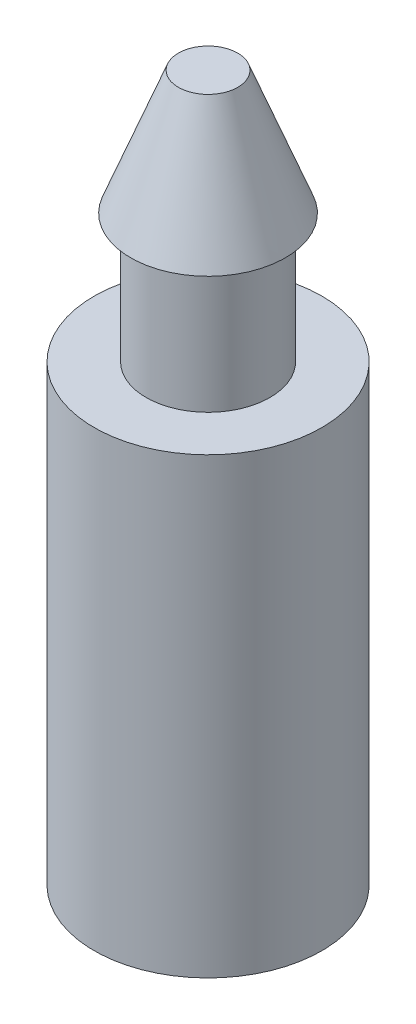
ISO-10303-21;
HEADER;
FILE_DESCRIPTION(('STEP AP214'),'2;1');
FILE_NAME('part.step','',(''),(''),'','','');
FILE_SCHEMA(('AUTOMOTIVE_DESIGN { 1 0 10303 214 1 1 1 1 }'));
ENDSEC;
DATA;
#1=APPLICATION_CONTEXT('core data for automotive mechanical design processes');
#2=APPLICATION_PROTOCOL_DEFINITION('international standard','automotive_design',2000,#1);
#3=PRODUCT_CONTEXT('',#1,'mechanical');
#4=PRODUCT('Part','Part','',(#3));
#5=PRODUCT_RELATED_PRODUCT_CATEGORY('part','',(#4));
#6=PRODUCT_DEFINITION_FORMATION('','',#4);
#7=PRODUCT_DEFINITION_CONTEXT('part definition',#1,'design');
#8=PRODUCT_DEFINITION('design','',#6,#7);
#9=PRODUCT_DEFINITION_SHAPE('','',#8);
#10=(LENGTH_UNIT() NAMED_UNIT(*) SI_UNIT(.MILLI.,.METRE.));
#11=(NAMED_UNIT(*) PLANE_ANGLE_UNIT() SI_UNIT($,.RADIAN.));
#12=(NAMED_UNIT(*) SI_UNIT($,.STERADIAN.) SOLID_ANGLE_UNIT());
#13=UNCERTAINTY_MEASURE_WITH_UNIT(LENGTH_MEASURE(1.E-05),#10,'distance_accuracy_value','');
#14=(GEOMETRIC_REPRESENTATION_CONTEXT(3) GLOBAL_UNCERTAINTY_ASSIGNED_CONTEXT((#13)) GLOBAL_UNIT_ASSIGNED_CONTEXT((#10,
#11,#12)) REPRESENTATION_CONTEXT('',''));
#15=CARTESIAN_POINT('',(0.,0.,0.));
#16=DIRECTION('',(0.,0.,1.));
#17=DIRECTION('',(1.,0.,0.));
#18=AXIS2_PLACEMENT_3D('',#15,#16,#17);
#19=CARTESIAN_POINT('',(1.1684,0.,0.));
#20=DIRECTION('',(0.,-1.,0.));
#21=DIRECTION('',(0.,0.,-1.));
#22=AXIS2_PLACEMENT_3D('',#19,#20,#21);
#23=PLANE('',#22);
#24=CARTESIAN_POINT('',(0.,0.,0.));
#25=DIRECTION('',(0.,-1.,0.));
#26=DIRECTION('',(0.,0.,-1.));
#27=AXIS2_PLACEMENT_3D('',#24,#25,#26);
#28=CIRCLE('',#27,1.1684);
#29=CARTESIAN_POINT('',(0.,0.,-1.1684));
#30=VERTEX_POINT('',#29);
#31=EDGE_CURVE('E67',#30,#30,#28,.T.);
#32=ORIENTED_EDGE('',*,*,#31,.T.);
#33=EDGE_LOOP('',(#32));
#34=FACE_BOUND('',#33,.T.);
#35=ADVANCED_FACE('F38',(#34),#23,.T.);
#36=CARTESIAN_POINT('',(0.,7.239,0.));
#37=DIRECTION('',(0.,1.,0.));
#38=DIRECTION('',(0.,0.,1.));
#39=AXIS2_PLACEMENT_3D('',#36,#37,#38);
#40=PLANE('',#39);
#41=CARTESIAN_POINT('',(0.,7.239,0.));
#42=DIRECTION('',(0.,-1.,0.));
#43=DIRECTION('',(0.,0.,-1.));
#44=AXIS2_PLACEMENT_3D('',#41,#42,#43);
#45=CIRCLE('',#44,0.304382522547571);
#46=CARTESIAN_POINT('',(0.,7.239,-0.304382522547571));
#47=VERTEX_POINT('',#46);
#48=EDGE_CURVE('E10',#47,#47,#45,.T.);
#49=ORIENTED_EDGE('',*,*,#48,.F.);
#50=EDGE_LOOP('',(#49));
#51=FACE_BOUND('',#50,.T.);
#52=ADVANCED_FACE('F86',(#51),#40,.T.);
#53=CARTESIAN_POINT('',(0.,5.969,0.));
#54=DIRECTION('',(0.,-1.,0.));
#55=DIRECTION('',(0.,0.,-1.));
#56=AXIS2_PLACEMENT_3D('',#53,#54,#55);
#57=CONICAL_SURFACE('',#56,0.79375,0.367795098068462);
#58=ORIENTED_EDGE('',*,*,#48,.T.);
#59=EDGE_LOOP('',(#58));
#60=FACE_BOUND('',#59,.T.);
#61=CARTESIAN_POINT('',(0.,5.969,0.));
#62=DIRECTION('',(0.,-1.,0.));
#63=DIRECTION('',(0.,0.,-1.));
#64=AXIS2_PLACEMENT_3D('',#61,#62,#63);
#65=CIRCLE('',#64,0.79375);
#66=CARTESIAN_POINT('',(0.,5.969,-0.79375));
#67=VERTEX_POINT('',#66);
#68=EDGE_CURVE('E45',#67,#67,#65,.T.);
#69=ORIENTED_EDGE('',*,*,#68,.F.);
#70=EDGE_LOOP('',(#69));
#71=FACE_BOUND('',#70,.T.);
#72=ADVANCED_FACE('F90',(#60,#71),#57,.T.);
#73=CARTESIAN_POINT('',(0.635,5.969,0.));
#74=DIRECTION('',(0.,-1.,0.));
#75=DIRECTION('',(0.,0.,-1.));
#76=AXIS2_PLACEMENT_3D('',#73,#74,#75);
#77=PLANE('',#76);
#78=ORIENTED_EDGE('',*,*,#68,.T.);
#79=EDGE_LOOP('',(#78));
#80=FACE_BOUND('',#79,.T.);
#81=CARTESIAN_POINT('',(0.,5.969,0.));
#82=DIRECTION('',(0.,-1.,0.));
#83=DIRECTION('',(0.,0.,-1.));
#84=AXIS2_PLACEMENT_3D('',#81,#82,#83);
#85=CIRCLE('',#84,0.635);
#86=CARTESIAN_POINT('',(0.,5.969,-0.635));
#87=VERTEX_POINT('',#86);
#88=EDGE_CURVE('E51',#87,#87,#85,.T.);
#89=ORIENTED_EDGE('',*,*,#88,.F.);
#90=EDGE_LOOP('',(#89));
#91=FACE_BOUND('',#90,.T.);
#92=ADVANCED_FACE('F95',(#80,#91),#77,.T.);
#93=CARTESIAN_POINT('',(0.,0.,0.));
#94=DIRECTION('',(0.,-1.,0.));
#95=DIRECTION('',(0.,0.,-1.));
#96=AXIS2_PLACEMENT_3D('',#93,#94,#95);
#97=CYLINDRICAL_SURFACE('',#96,0.635);
#98=ORIENTED_EDGE('',*,*,#88,.T.);
#99=EDGE_LOOP('',(#98));
#100=FACE_BOUND('',#99,.T.);
#101=CARTESIAN_POINT('',(0.,4.6482,0.));
#102=DIRECTION('',(0.,-1.,0.));
#103=DIRECTION('',(0.,0.,-1.));
#104=AXIS2_PLACEMENT_3D('',#101,#102,#103);
#105=CIRCLE('',#104,0.635);
#106=CARTESIAN_POINT('',(0.,4.6482,-0.635));
#107=VERTEX_POINT('',#106);
#108=EDGE_CURVE('E57',#107,#107,#105,.T.);
#109=ORIENTED_EDGE('',*,*,#108,.F.);
#110=EDGE_LOOP('',(#109));
#111=FACE_BOUND('',#110,.T.);
#112=ADVANCED_FACE('F82',(#100,#111),#97,.T.);
#113=CARTESIAN_POINT('',(0.635,4.6482,0.));
#114=DIRECTION('',(0.,1.,0.));
#115=DIRECTION('',(0.,0.,1.));
#116=AXIS2_PLACEMENT_3D('',#113,#114,#115);
#117=PLANE('',#116);
#118=ORIENTED_EDGE('',*,*,#108,.T.);
#119=EDGE_LOOP('',(#118));
#120=FACE_BOUND('',#119,.T.);
#121=CARTESIAN_POINT('',(0.,4.6482,0.));
#122=DIRECTION('',(0.,-1.,0.));
#123=DIRECTION('',(0.,0.,-1.));
#124=AXIS2_PLACEMENT_3D('',#121,#122,#123);
#125=CIRCLE('',#124,1.1684);
#126=CARTESIAN_POINT('',(0.,4.6482,-1.1684));
#127=VERTEX_POINT('',#126);
#128=EDGE_CURVE('E63',#127,#127,#125,.T.);
#129=ORIENTED_EDGE('',*,*,#128,.F.);
#130=EDGE_LOOP('',(#129));
#131=FACE_BOUND('',#130,.T.);
#132=ADVANCED_FACE('F76',(#120,#131),#117,.T.);
#133=CARTESIAN_POINT('',(0.,0.,0.));
#134=DIRECTION('',(0.,-1.,0.));
#135=DIRECTION('',(0.,0.,-1.));
#136=AXIS2_PLACEMENT_3D('',#133,#134,#135);
#137=CYLINDRICAL_SURFACE('',#136,1.1684);
#138=ORIENTED_EDGE('',*,*,#128,.T.);
#139=EDGE_LOOP('',(#138));
#140=FACE_BOUND('',#139,.T.);
#141=ORIENTED_EDGE('',*,*,#31,.F.);
#142=EDGE_LOOP('',(#141));
#143=FACE_BOUND('',#142,.T.);
#144=ADVANCED_FACE('F74',(#140,#143),#137,.T.);
#145=CLOSED_SHELL('',(#35,#52,#72,#92,#112,#132,#144));
#146=MANIFOLD_SOLID_BREP('B2',#145);
#147=ADVANCED_BREP_SHAPE_REPRESENTATION('',(#18,#146),#14);
#148=SHAPE_DEFINITION_REPRESENTATION(#9,#147);
ENDSEC;
END-ISO-10303-21;
